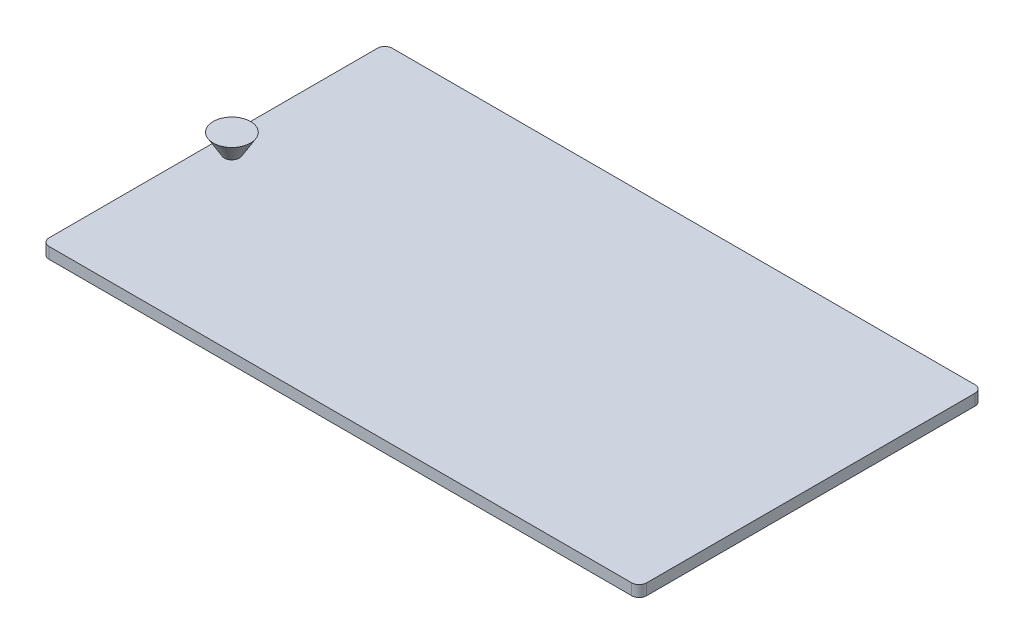
ISO-10303-21;
HEADER;
FILE_DESCRIPTION(('STEP AP214'),'2;1');
FILE_NAME('part.step','',(''),(''),'','','');
FILE_SCHEMA(('AUTOMOTIVE_DESIGN { 1 0 10303 214 1 1 1 1 }'));
ENDSEC;
DATA;
#1=APPLICATION_CONTEXT('core data for automotive mechanical design processes');
#2=APPLICATION_PROTOCOL_DEFINITION('international standard','automotive_design',2000,#1);
#3=PRODUCT_CONTEXT('',#1,'mechanical');
#4=PRODUCT('Part','Part','',(#3));
#5=PRODUCT_RELATED_PRODUCT_CATEGORY('part','',(#4));
#6=PRODUCT_DEFINITION_FORMATION('','',#4);
#7=PRODUCT_DEFINITION_CONTEXT('part definition',#1,'design');
#8=PRODUCT_DEFINITION('design','',#6,#7);
#9=PRODUCT_DEFINITION_SHAPE('','',#8);
#10=(LENGTH_UNIT() NAMED_UNIT(*) SI_UNIT(.MILLI.,.METRE.));
#11=(NAMED_UNIT(*) PLANE_ANGLE_UNIT() SI_UNIT($,.RADIAN.));
#12=(NAMED_UNIT(*) SI_UNIT($,.STERADIAN.) SOLID_ANGLE_UNIT());
#13=UNCERTAINTY_MEASURE_WITH_UNIT(LENGTH_MEASURE(1.E-05),#10,'distance_accuracy_value','');
#14=(GEOMETRIC_REPRESENTATION_CONTEXT(3) GLOBAL_UNCERTAINTY_ASSIGNED_CONTEXT((#13)) GLOBAL_UNIT_ASSIGNED_CONTEXT((#10,
#11,#12)) REPRESENTATION_CONTEXT('',''));
#15=CARTESIAN_POINT('',(0.,0.,0.));
#16=DIRECTION('',(0.,0.,1.));
#17=DIRECTION('',(1.,0.,0.));
#18=AXIS2_PLACEMENT_3D('',#15,#16,#17);
#19=CARTESIAN_POINT('',(-78.,3.,-43.95));
#20=DIRECTION('',(0.,1.,0.));
#21=DIRECTION('',(0.,0.,1.));
#22=AXIS2_PLACEMENT_3D('',#19,#20,#21);
#23=PLANE('',#22);
#24=CARTESIAN_POINT('',(-78.,3.,-43.95));
#25=DIRECTION('',(0.,1.,0.));
#26=DIRECTION('',(0.,0.,1.));
#27=AXIS2_PLACEMENT_3D('',#24,#25,#26);
#28=CIRCLE('',#27,2.);
#29=CARTESIAN_POINT('',(-78.,3.,-45.95));
#30=VERTEX_POINT('',#29);
#31=CARTESIAN_POINT('',(-80.,3.,-43.95));
#32=VERTEX_POINT('',#31);
#33=EDGE_CURVE('E161',#30,#32,#28,.T.);
#34=ORIENTED_EDGE('',*,*,#33,.T.);
#35=DIRECTION('',(0.,0.,1.));
#36=VECTOR('',#35,1.);
#37=CARTESIAN_POINT('',(-80.,3.,-43.95));
#38=LINE('',#37,#36);
#39=CARTESIAN_POINT('',(-80.,3.,43.95));
#40=VERTEX_POINT('',#39);
#41=EDGE_CURVE('E109',#32,#40,#38,.T.);
#42=ORIENTED_EDGE('',*,*,#41,.T.);
#43=CARTESIAN_POINT('',(-78.,3.,43.95));
#44=DIRECTION('',(0.,1.,0.));
#45=DIRECTION('',(0.,0.,-1.));
#46=AXIS2_PLACEMENT_3D('',#43,#44,#45);
#47=CIRCLE('',#46,2.);
#48=CARTESIAN_POINT('',(-78.,3.,45.95));
#49=VERTEX_POINT('',#48);
#50=EDGE_CURVE('E176',#40,#49,#47,.T.);
#51=ORIENTED_EDGE('',*,*,#50,.T.);
#52=DIRECTION('',(1.,0.,0.));
#53=VECTOR('',#52,1.);
#54=CARTESIAN_POINT('',(-78.,3.,45.95));
#55=LINE('',#54,#53);
#56=CARTESIAN_POINT('',(77.9999999999999,3.,45.95));
#57=VERTEX_POINT('',#56);
#58=EDGE_CURVE('E188',#49,#57,#55,.T.);
#59=ORIENTED_EDGE('',*,*,#58,.T.);
#60=CARTESIAN_POINT('',(78.,3.,43.95));
#61=DIRECTION('',(0.,1.,0.));
#62=DIRECTION('',(0.,0.,1.));
#63=AXIS2_PLACEMENT_3D('',#60,#61,#62);
#64=CIRCLE('',#63,2.);
#65=CARTESIAN_POINT('',(80.,3.,43.95));
#66=VERTEX_POINT('',#65);
#67=EDGE_CURVE('E128',#57,#66,#64,.T.);
#68=ORIENTED_EDGE('',*,*,#67,.T.);
#69=DIRECTION('',(0.,0.,-1.));
#70=VECTOR('',#69,1.);
#71=CARTESIAN_POINT('',(80.,3.,-43.95));
#72=LINE('',#71,#70);
#73=CARTESIAN_POINT('',(80.,3.,-43.95));
#74=VERTEX_POINT('',#73);
#75=EDGE_CURVE('E122',#66,#74,#72,.T.);
#76=ORIENTED_EDGE('',*,*,#75,.T.);
#77=CARTESIAN_POINT('',(78.,3.,-43.95));
#78=DIRECTION('',(0.,1.,0.));
#79=DIRECTION('',(0.,0.,1.));
#80=AXIS2_PLACEMENT_3D('',#77,#78,#79);
#81=CIRCLE('',#80,2.);
#82=CARTESIAN_POINT('',(78.,3.,-45.95));
#83=VERTEX_POINT('',#82);
#84=EDGE_CURVE('E126',#74,#83,#81,.T.);
#85=ORIENTED_EDGE('',*,*,#84,.T.);
#86=DIRECTION('',(-1.,0.,0.));
#87=VECTOR('',#86,1.);
#88=CARTESIAN_POINT('',(-78.,3.,-45.95));
#89=LINE('',#88,#87);
#90=EDGE_CURVE('E66',#83,#30,#89,.T.);
#91=ORIENTED_EDGE('',*,*,#90,.T.);
#92=EDGE_LOOP('',(#34,#42,#51,#59,#68,#76,#85,#91));
#93=FACE_BOUND('',#92,.T.);
#94=CARTESIAN_POINT('',(-75.,3.,0.));
#95=DIRECTION('',(0.,1.,0.));
#96=DIRECTION('',(0.,0.,1.));
#97=AXIS2_PLACEMENT_3D('',#94,#95,#96);
#98=CIRCLE('',#97,2.);
#99=CARTESIAN_POINT('',(-75.,3.,2.));
#100=VERTEX_POINT('',#99);
#101=EDGE_CURVE('E150',#100,#100,#98,.T.);
#102=ORIENTED_EDGE('',*,*,#101,.F.);
#103=EDGE_LOOP('',(#102));
#104=FACE_BOUND('',#103,.T.);
#105=ADVANCED_FACE('F49',(#93,#104),#23,.T.);
#106=CARTESIAN_POINT('',(-78.,3.,-43.95));
#107=DIRECTION('',(0.,-1.,0.));
#108=DIRECTION('',(0.,0.,-1.));
#109=AXIS2_PLACEMENT_3D('',#106,#107,#108);
#110=CYLINDRICAL_SURFACE('',#109,2.);
#111=CARTESIAN_POINT('',(-78.,0.,-43.95));
#112=DIRECTION('',(0.,1.,0.));
#113=DIRECTION('',(0.,0.,1.));
#114=AXIS2_PLACEMENT_3D('',#111,#112,#113);
#115=CIRCLE('',#114,2.);
#116=CARTESIAN_POINT('',(-78.,0.,-45.95));
#117=VERTEX_POINT('',#116);
#118=CARTESIAN_POINT('',(-80.,0.,-43.95));
#119=VERTEX_POINT('',#118);
#120=EDGE_CURVE('E146',#117,#119,#115,.T.);
#121=ORIENTED_EDGE('',*,*,#120,.T.);
#122=DIRECTION('',(0.,-1.,0.));
#123=VECTOR('',#122,1.);
#124=CARTESIAN_POINT('',(-80.,3.,-43.95));
#125=LINE('',#124,#123);
#126=EDGE_CURVE('E12',#32,#119,#125,.T.);
#127=ORIENTED_EDGE('',*,*,#126,.F.);
#128=ORIENTED_EDGE('',*,*,#33,.F.);
#129=DIRECTION('',(0.,-1.,0.));
#130=VECTOR('',#129,1.);
#131=CARTESIAN_POINT('',(-78.,3.,-45.95));
#132=LINE('',#131,#130);
#133=EDGE_CURVE('E142',#30,#117,#132,.T.);
#134=ORIENTED_EDGE('',*,*,#133,.T.);
#135=EDGE_LOOP('',(#121,#127,#128,#134));
#136=FACE_BOUND('',#135,.T.);
#137=ADVANCED_FACE('F51',(#136),#110,.T.);
#138=CARTESIAN_POINT('',(-80.,3.,-43.95));
#139=DIRECTION('',(1.,0.,0.));
#140=DIRECTION('',(0.,0.,-1.));
#141=AXIS2_PLACEMENT_3D('',#138,#139,#140);
#142=PLANE('',#141);
#143=DIRECTION('',(0.,0.,1.));
#144=VECTOR('',#143,1.);
#145=CARTESIAN_POINT('',(-80.,0.,-43.95));
#146=LINE('',#145,#144);
#147=CARTESIAN_POINT('',(-80.,0.,43.95));
#148=VERTEX_POINT('',#147);
#149=EDGE_CURVE('E149',#119,#148,#146,.T.);
#150=ORIENTED_EDGE('',*,*,#149,.T.);
#151=DIRECTION('',(0.,-1.,0.));
#152=VECTOR('',#151,1.);
#153=CARTESIAN_POINT('',(-80.,3.,43.95));
#154=LINE('',#153,#152);
#155=EDGE_CURVE('E58',#40,#148,#154,.T.);
#156=ORIENTED_EDGE('',*,*,#155,.F.);
#157=ORIENTED_EDGE('',*,*,#41,.F.);
#158=ORIENTED_EDGE('',*,*,#126,.T.);
#159=EDGE_LOOP('',(#150,#156,#157,#158));
#160=FACE_BOUND('',#159,.T.);
#161=ADVANCED_FACE('F236',(#160),#142,.F.);
#162=CARTESIAN_POINT('',(-78.,3.,43.95));
#163=DIRECTION('',(0.,-1.,0.));
#164=DIRECTION('',(0.,0.,-1.));
#165=AXIS2_PLACEMENT_3D('',#162,#163,#164);
#166=CYLINDRICAL_SURFACE('',#165,2.);
#167=CARTESIAN_POINT('',(-78.,0.,43.95));
#168=DIRECTION('',(0.,1.,0.));
#169=DIRECTION('',(0.,0.,-1.));
#170=AXIS2_PLACEMENT_3D('',#167,#168,#169);
#171=CIRCLE('',#170,2.);
#172=CARTESIAN_POINT('',(-78.,0.,45.95));
#173=VERTEX_POINT('',#172);
#174=EDGE_CURVE('E152',#148,#173,#171,.T.);
#175=ORIENTED_EDGE('',*,*,#174,.T.);
#176=DIRECTION('',(0.,-1.,0.));
#177=VECTOR('',#176,1.);
#178=CARTESIAN_POINT('',(-78.,3.,45.95));
#179=LINE('',#178,#177);
#180=EDGE_CURVE('E168',#49,#173,#179,.T.);
#181=ORIENTED_EDGE('',*,*,#180,.F.);
#182=ORIENTED_EDGE('',*,*,#50,.F.);
#183=ORIENTED_EDGE('',*,*,#155,.T.);
#184=EDGE_LOOP('',(#175,#181,#182,#183));
#185=FACE_BOUND('',#184,.T.);
#186=ADVANCED_FACE('F174',(#185),#166,.T.);
#187=CARTESIAN_POINT('',(-78.,3.,45.95));
#188=DIRECTION('',(0.,0.,-1.));
#189=DIRECTION('',(-1.,0.,0.));
#190=AXIS2_PLACEMENT_3D('',#187,#188,#189);
#191=PLANE('',#190);
#192=DIRECTION('',(1.,0.,0.));
#193=VECTOR('',#192,1.);
#194=CARTESIAN_POINT('',(-78.,0.,45.95));
#195=LINE('',#194,#193);
#196=CARTESIAN_POINT('',(77.9999999999999,0.,45.95));
#197=VERTEX_POINT('',#196);
#198=EDGE_CURVE('E154',#173,#197,#195,.T.);
#199=ORIENTED_EDGE('',*,*,#198,.T.);
#200=DIRECTION('',(0.,-1.,0.));
#201=VECTOR('',#200,1.);
#202=CARTESIAN_POINT('',(77.9999999999999,3.,45.95));
#203=LINE('',#202,#201);
#204=EDGE_CURVE('E165',#57,#197,#203,.T.);
#205=ORIENTED_EDGE('',*,*,#204,.F.);
#206=ORIENTED_EDGE('',*,*,#58,.F.);
#207=ORIENTED_EDGE('',*,*,#180,.T.);
#208=EDGE_LOOP('',(#199,#205,#206,#207));
#209=FACE_BOUND('',#208,.T.);
#210=ADVANCED_FACE('F184',(#209),#191,.F.);
#211=CARTESIAN_POINT('',(78.,3.,43.95));
#212=DIRECTION('',(0.,-1.,0.));
#213=DIRECTION('',(0.,0.,-1.));
#214=AXIS2_PLACEMENT_3D('',#211,#212,#213);
#215=CYLINDRICAL_SURFACE('',#214,2.);
#216=CARTESIAN_POINT('',(78.,0.,43.95));
#217=DIRECTION('',(0.,1.,0.));
#218=DIRECTION('',(0.,0.,1.));
#219=AXIS2_PLACEMENT_3D('',#216,#217,#218);
#220=CIRCLE('',#219,2.);
#221=CARTESIAN_POINT('',(80.,0.,43.95));
#222=VERTEX_POINT('',#221);
#223=EDGE_CURVE('E156',#197,#222,#220,.T.);
#224=ORIENTED_EDGE('',*,*,#223,.T.);
#225=DIRECTION('',(0.,-1.,0.));
#226=VECTOR('',#225,1.);
#227=CARTESIAN_POINT('',(80.,3.,43.95));
#228=LINE('',#227,#226);
#229=EDGE_CURVE('E137',#66,#222,#228,.T.);
#230=ORIENTED_EDGE('',*,*,#229,.F.);
#231=ORIENTED_EDGE('',*,*,#67,.F.);
#232=ORIENTED_EDGE('',*,*,#204,.T.);
#233=EDGE_LOOP('',(#224,#230,#231,#232));
#234=FACE_BOUND('',#233,.T.);
#235=ADVANCED_FACE('F187',(#234),#215,.T.);
#236=CARTESIAN_POINT('',(80.,3.,-43.95));
#237=DIRECTION('',(-1.,0.,0.));
#238=DIRECTION('',(0.,0.,1.));
#239=AXIS2_PLACEMENT_3D('',#236,#237,#238);
#240=PLANE('',#239);
#241=DIRECTION('',(0.,0.,-1.));
#242=VECTOR('',#241,1.);
#243=CARTESIAN_POINT('',(80.,0.,-43.95));
#244=LINE('',#243,#242);
#245=CARTESIAN_POINT('',(80.,0.,-43.95));
#246=VERTEX_POINT('',#245);
#247=EDGE_CURVE('E136',#222,#246,#244,.T.);
#248=ORIENTED_EDGE('',*,*,#247,.T.);
#249=DIRECTION('',(0.,-1.,0.));
#250=VECTOR('',#249,1.);
#251=CARTESIAN_POINT('',(80.,3.,-43.95));
#252=LINE('',#251,#250);
#253=EDGE_CURVE('E133',#74,#246,#252,.T.);
#254=ORIENTED_EDGE('',*,*,#253,.F.);
#255=ORIENTED_EDGE('',*,*,#75,.F.);
#256=ORIENTED_EDGE('',*,*,#229,.T.);
#257=EDGE_LOOP('',(#248,#254,#255,#256));
#258=FACE_BOUND('',#257,.T.);
#259=ADVANCED_FACE('F134',(#258),#240,.F.);
#260=CARTESIAN_POINT('',(78.,3.,-43.95));
#261=DIRECTION('',(0.,-1.,0.));
#262=DIRECTION('',(0.,0.,-1.));
#263=AXIS2_PLACEMENT_3D('',#260,#261,#262);
#264=CYLINDRICAL_SURFACE('',#263,2.);
#265=CARTESIAN_POINT('',(78.,0.,-43.95));
#266=DIRECTION('',(0.,1.,0.));
#267=DIRECTION('',(0.,0.,1.));
#268=AXIS2_PLACEMENT_3D('',#265,#266,#267);
#269=CIRCLE('',#268,2.);
#270=CARTESIAN_POINT('',(78.,0.,-45.95));
#271=VERTEX_POINT('',#270);
#272=EDGE_CURVE('E95',#246,#271,#269,.T.);
#273=ORIENTED_EDGE('',*,*,#272,.T.);
#274=DIRECTION('',(0.,-1.,0.));
#275=VECTOR('',#274,1.);
#276=CARTESIAN_POINT('',(78.,3.,-45.95));
#277=LINE('',#276,#275);
#278=EDGE_CURVE('E138',#83,#271,#277,.T.);
#279=ORIENTED_EDGE('',*,*,#278,.F.);
#280=ORIENTED_EDGE('',*,*,#84,.F.);
#281=ORIENTED_EDGE('',*,*,#253,.T.);
#282=EDGE_LOOP('',(#273,#279,#280,#281));
#283=FACE_BOUND('',#282,.T.);
#284=ADVANCED_FACE('F140',(#283),#264,.T.);
#285=CARTESIAN_POINT('',(-78.,3.,-45.95));
#286=DIRECTION('',(0.,0.,1.));
#287=DIRECTION('',(1.,0.,0.));
#288=AXIS2_PLACEMENT_3D('',#285,#286,#287);
#289=PLANE('',#288);
#290=DIRECTION('',(-1.,0.,0.));
#291=VECTOR('',#290,1.);
#292=CARTESIAN_POINT('',(-78.,0.,-45.95));
#293=LINE('',#292,#291);
#294=EDGE_CURVE('E101',#271,#117,#293,.T.);
#295=ORIENTED_EDGE('',*,*,#294,.T.);
#296=ORIENTED_EDGE('',*,*,#133,.F.);
#297=ORIENTED_EDGE('',*,*,#90,.F.);
#298=ORIENTED_EDGE('',*,*,#278,.T.);
#299=EDGE_LOOP('',(#295,#296,#297,#298));
#300=FACE_BOUND('',#299,.T.);
#301=ADVANCED_FACE('F243',(#300),#289,.F.);
#302=CARTESIAN_POINT('',(-78.,0.,-43.95));
#303=DIRECTION('',(0.,1.,0.));
#304=DIRECTION('',(0.,0.,1.));
#305=AXIS2_PLACEMENT_3D('',#302,#303,#304);
#306=PLANE('',#305);
#307=ORIENTED_EDGE('',*,*,#120,.F.);
#308=ORIENTED_EDGE('',*,*,#294,.F.);
#309=ORIENTED_EDGE('',*,*,#272,.F.);
#310=ORIENTED_EDGE('',*,*,#247,.F.);
#311=ORIENTED_EDGE('',*,*,#223,.F.);
#312=ORIENTED_EDGE('',*,*,#198,.F.);
#313=ORIENTED_EDGE('',*,*,#174,.F.);
#314=ORIENTED_EDGE('',*,*,#149,.F.);
#315=EDGE_LOOP('',(#307,#308,#309,#310,#311,#312,#313,#314));
#316=FACE_BOUND('',#315,.T.);
#317=ADVANCED_FACE('F180',(#316),#306,.F.);
#318=CARTESIAN_POINT('',(-75.,8.,0.));
#319=DIRECTION('',(0.,1.,0.));
#320=DIRECTION('',(0.,0.,1.));
#321=AXIS2_PLACEMENT_3D('',#318,#319,#320);
#322=PLANE('',#321);
#323=CARTESIAN_POINT('',(-75.,8.,0.));
#324=DIRECTION('',(0.,1.,0.));
#325=DIRECTION('',(0.,0.,1.));
#326=AXIS2_PLACEMENT_3D('',#323,#324,#325);
#327=CIRCLE('',#326,5.);
#328=CARTESIAN_POINT('',(-75.,8.,5.));
#329=VERTEX_POINT('',#328);
#330=EDGE_CURVE('E196',#329,#329,#327,.T.);
#331=ORIENTED_EDGE('',*,*,#330,.T.);
#332=EDGE_LOOP('',(#331));
#333=FACE_BOUND('',#332,.T.);
#334=ADVANCED_FACE('F206',(#333),#322,.T.);
#335=CARTESIAN_POINT('',(-75.,3.,0.));
#336=DIRECTION('',(0.,1.,0.));
#337=DIRECTION('',(0.,0.,1.));
#338=AXIS2_PLACEMENT_3D('',#335,#336,#337);
#339=CONICAL_SURFACE('',#338,2.,0.540419500270585);
#340=ORIENTED_EDGE('',*,*,#330,.F.);
#341=EDGE_LOOP('',(#340));
#342=FACE_BOUND('',#341,.T.);
#343=ORIENTED_EDGE('',*,*,#101,.T.);
#344=EDGE_LOOP('',(#343));
#345=FACE_BOUND('',#344,.T.);
#346=ADVANCED_FACE('F215',(#342,#345),#339,.T.);
#347=CLOSED_SHELL('',(#105,#137,#161,#186,#210,#235,#259,#284,#301,#317,#334,#346));
#348=MANIFOLD_SOLID_BREP('B2',#347);
#349=ADVANCED_BREP_SHAPE_REPRESENTATION('',(#18,#348),#14);
#350=SHAPE_DEFINITION_REPRESENTATION(#9,#349);
ENDSEC;
END-ISO-10303-21;
